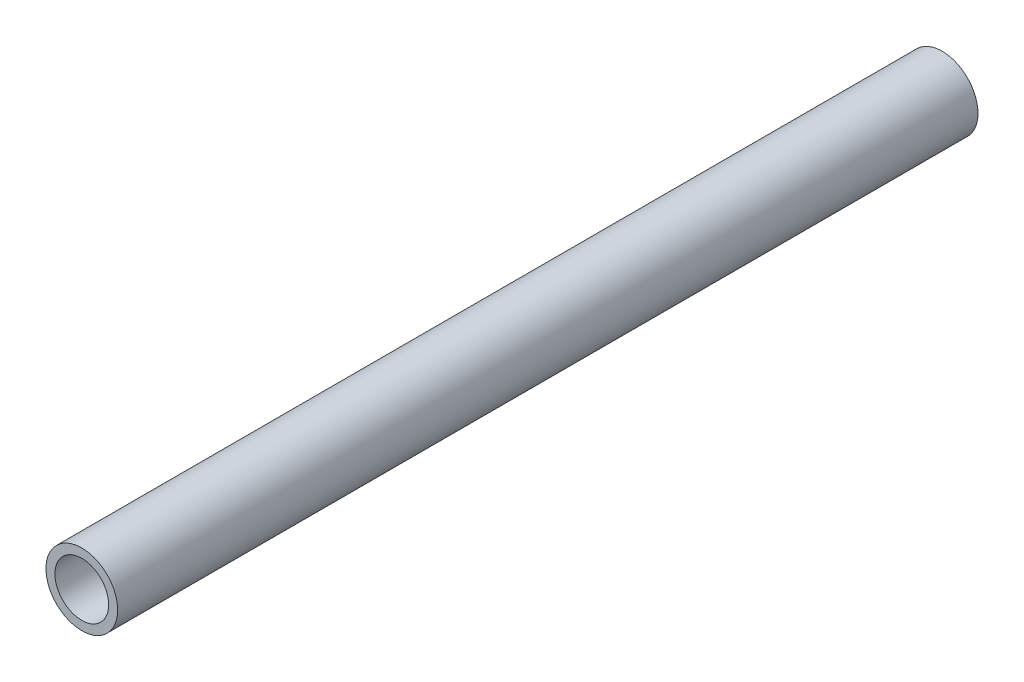
ISO-10303-21;
HEADER;
FILE_DESCRIPTION(('STEP AP214'),'2;1');
FILE_NAME('part.step','',(''),(''),'','','');
FILE_SCHEMA(('AUTOMOTIVE_DESIGN { 1 0 10303 214 1 1 1 1 }'));
ENDSEC;
DATA;
#1=APPLICATION_CONTEXT('core data for automotive mechanical design processes');
#2=APPLICATION_PROTOCOL_DEFINITION('international standard','automotive_design',2000,#1);
#3=PRODUCT_CONTEXT('',#1,'mechanical');
#4=PRODUCT('Part','Part','',(#3));
#5=PRODUCT_RELATED_PRODUCT_CATEGORY('part','',(#4));
#6=PRODUCT_DEFINITION_FORMATION('','',#4);
#7=PRODUCT_DEFINITION_CONTEXT('part definition',#1,'design');
#8=PRODUCT_DEFINITION('design','',#6,#7);
#9=PRODUCT_DEFINITION_SHAPE('','',#8);
#10=(LENGTH_UNIT() NAMED_UNIT(*) SI_UNIT(.MILLI.,.METRE.));
#11=(NAMED_UNIT(*) PLANE_ANGLE_UNIT() SI_UNIT($,.RADIAN.));
#12=(NAMED_UNIT(*) SI_UNIT($,.STERADIAN.) SOLID_ANGLE_UNIT());
#13=UNCERTAINTY_MEASURE_WITH_UNIT(LENGTH_MEASURE(1.E-05),#10,'distance_accuracy_value','');
#14=(GEOMETRIC_REPRESENTATION_CONTEXT(3) GLOBAL_UNCERTAINTY_ASSIGNED_CONTEXT((#13)) GLOBAL_UNIT_ASSIGNED_CONTEXT((#10,
#11,#12)) REPRESENTATION_CONTEXT('',''));
#15=CARTESIAN_POINT('',(0.,0.,0.));
#16=DIRECTION('',(0.,0.,1.));
#17=DIRECTION('',(1.,0.,0.));
#18=AXIS2_PLACEMENT_3D('',#15,#16,#17);
#19=CARTESIAN_POINT('',(0.,0.,76.2));
#20=DIRECTION('',(0.,0.,1.));
#21=DIRECTION('',(1.,0.,0.));
#22=AXIS2_PLACEMENT_3D('',#19,#20,#21);
#23=PLANE('',#22);
#24=CARTESIAN_POINT('',(0.,0.,76.2));
#25=DIRECTION('',(0.,0.,1.));
#26=DIRECTION('',(1.,0.,0.));
#27=AXIS2_PLACEMENT_3D('',#24,#25,#26);
#28=CIRCLE('',#27,6.35);
#29=CARTESIAN_POINT('',(6.35,0.,76.2));
#30=VERTEX_POINT('',#29);
#31=EDGE_CURVE('E10',#30,#30,#28,.T.);
#32=ORIENTED_EDGE('',*,*,#31,.T.);
#33=EDGE_LOOP('',(#32));
#34=FACE_BOUND('',#33,.T.);
#35=CARTESIAN_POINT('',(0.,0.,76.2));
#36=DIRECTION('',(0.,0.,1.));
#37=DIRECTION('',(1.,0.,0.));
#38=AXIS2_PLACEMENT_3D('',#35,#36,#37);
#39=CIRCLE('',#38,4.7625);
#40=CARTESIAN_POINT('',(4.7625,0.,76.2));
#41=VERTEX_POINT('',#40);
#42=EDGE_CURVE('E42',#41,#41,#39,.T.);
#43=ORIENTED_EDGE('',*,*,#42,.F.);
#44=EDGE_LOOP('',(#43));
#45=FACE_BOUND('',#44,.T.);
#46=ADVANCED_FACE('F31',(#34,#45),#23,.T.);
#47=CARTESIAN_POINT('',(0.,0.,-76.2));
#48=DIRECTION('',(0.,0.,1.));
#49=DIRECTION('',(1.,0.,0.));
#50=AXIS2_PLACEMENT_3D('',#47,#48,#49);
#51=PLANE('',#50);
#52=CARTESIAN_POINT('',(0.,0.,-76.2));
#53=DIRECTION('',(0.,0.,1.));
#54=DIRECTION('',(1.,0.,0.));
#55=AXIS2_PLACEMENT_3D('',#52,#53,#54);
#56=CIRCLE('',#55,6.35);
#57=CARTESIAN_POINT('',(6.35,0.,-76.2));
#58=VERTEX_POINT('',#57);
#59=EDGE_CURVE('E35',#58,#58,#56,.T.);
#60=ORIENTED_EDGE('',*,*,#59,.F.);
#61=EDGE_LOOP('',(#60));
#62=FACE_BOUND('',#61,.T.);
#63=CARTESIAN_POINT('',(0.,0.,-76.2));
#64=DIRECTION('',(0.,0.,1.));
#65=DIRECTION('',(1.,0.,0.));
#66=AXIS2_PLACEMENT_3D('',#63,#64,#65);
#67=CIRCLE('',#66,4.7625);
#68=CARTESIAN_POINT('',(4.7625,0.,-76.2));
#69=VERTEX_POINT('',#68);
#70=EDGE_CURVE('E44',#69,#69,#67,.T.);
#71=ORIENTED_EDGE('',*,*,#70,.T.);
#72=EDGE_LOOP('',(#71));
#73=FACE_BOUND('',#72,.T.);
#74=ADVANCED_FACE('F54',(#62,#73),#51,.F.);
#75=CARTESIAN_POINT('',(0.,0.,76.2));
#76=DIRECTION('',(0.,0.,-1.));
#77=DIRECTION('',(-1.,0.,0.));
#78=AXIS2_PLACEMENT_3D('',#75,#76,#77);
#79=CYLINDRICAL_SURFACE('',#78,6.35);
#80=ORIENTED_EDGE('',*,*,#31,.F.);
#81=EDGE_LOOP('',(#80));
#82=FACE_BOUND('',#81,.T.);
#83=ORIENTED_EDGE('',*,*,#59,.T.);
#84=EDGE_LOOP('',(#83));
#85=FACE_BOUND('',#84,.T.);
#86=ADVANCED_FACE('F33',(#82,#85),#79,.T.);
#87=CARTESIAN_POINT('',(0.,0.,76.2));
#88=DIRECTION('',(0.,0.,-1.));
#89=DIRECTION('',(-1.,0.,0.));
#90=AXIS2_PLACEMENT_3D('',#87,#88,#89);
#91=CYLINDRICAL_SURFACE('',#90,4.7625);
#92=ORIENTED_EDGE('',*,*,#42,.T.);
#93=EDGE_LOOP('',(#92));
#94=FACE_BOUND('',#93,.T.);
#95=ORIENTED_EDGE('',*,*,#70,.F.);
#96=EDGE_LOOP('',(#95));
#97=FACE_BOUND('',#96,.T.);
#98=ADVANCED_FACE('F50',(#94,#97),#91,.F.);
#99=CLOSED_SHELL('',(#46,#74,#86,#98));
#100=MANIFOLD_SOLID_BREP('B2',#99);
#101=ADVANCED_BREP_SHAPE_REPRESENTATION('',(#18,#100),#14);
#102=SHAPE_DEFINITION_REPRESENTATION(#9,#101);
ENDSEC;
END-ISO-10303-21;
